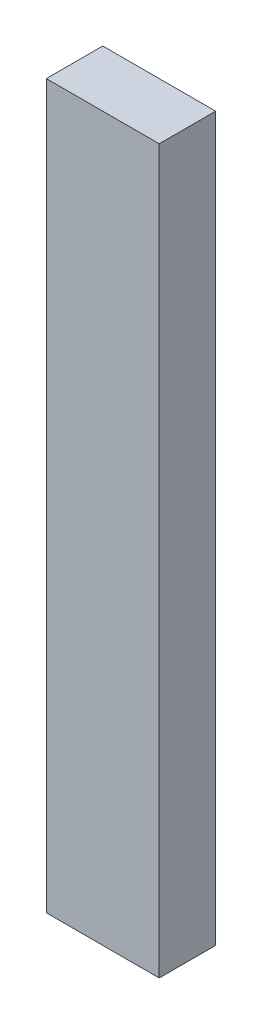
ISO-10303-21;
HEADER;
FILE_DESCRIPTION(('STEP AP214'),'2;1');
FILE_NAME('part.step','',(''),(''),'','','');
FILE_SCHEMA(('AUTOMOTIVE_DESIGN { 1 0 10303 214 1 1 1 1 }'));
ENDSEC;
DATA;
#1=APPLICATION_CONTEXT('core data for automotive mechanical design processes');
#2=APPLICATION_PROTOCOL_DEFINITION('international standard','automotive_design',2000,#1);
#3=PRODUCT_CONTEXT('',#1,'mechanical');
#4=PRODUCT('Part','Part','',(#3));
#5=PRODUCT_RELATED_PRODUCT_CATEGORY('part','',(#4));
#6=PRODUCT_DEFINITION_FORMATION('','',#4);
#7=PRODUCT_DEFINITION_CONTEXT('part definition',#1,'design');
#8=PRODUCT_DEFINITION('design','',#6,#7);
#9=PRODUCT_DEFINITION_SHAPE('','',#8);
#10=(LENGTH_UNIT() NAMED_UNIT(*) SI_UNIT(.MILLI.,.METRE.));
#11=(NAMED_UNIT(*) PLANE_ANGLE_UNIT() SI_UNIT($,.RADIAN.));
#12=(NAMED_UNIT(*) SI_UNIT($,.STERADIAN.) SOLID_ANGLE_UNIT());
#13=UNCERTAINTY_MEASURE_WITH_UNIT(LENGTH_MEASURE(1.E-05),#10,'distance_accuracy_value','');
#14=(GEOMETRIC_REPRESENTATION_CONTEXT(3) GLOBAL_UNCERTAINTY_ASSIGNED_CONTEXT((#13)) GLOBAL_UNIT_ASSIGNED_CONTEXT((#10,
#11,#12)) REPRESENTATION_CONTEXT('',''));
#15=CARTESIAN_POINT('',(0.,0.,0.));
#16=DIRECTION('',(0.,0.,1.));
#17=DIRECTION('',(1.,0.,0.));
#18=AXIS2_PLACEMENT_3D('',#15,#16,#17);
#19=CARTESIAN_POINT('',(0.25,3.2,-0.125));
#20=DIRECTION('',(-1.,0.,0.));
#21=DIRECTION('',(0.,0.,1.));
#22=AXIS2_PLACEMENT_3D('',#19,#20,#21);
#23=PLANE('',#22);
#24=DIRECTION('',(0.,0.,-1.));
#25=VECTOR('',#24,1.);
#26=CARTESIAN_POINT('',(0.25,0.,-0.125));
#27=LINE('',#26,#25);
#28=CARTESIAN_POINT('',(0.25,0.,0.125));
#29=VERTEX_POINT('',#28);
#30=CARTESIAN_POINT('',(0.25,0.,-0.125));
#31=VERTEX_POINT('',#30);
#32=EDGE_CURVE('E96',#29,#31,#27,.T.);
#33=ORIENTED_EDGE('',*,*,#32,.T.);
#34=DIRECTION('',(0.,-1.,0.));
#35=VECTOR('',#34,1.);
#36=CARTESIAN_POINT('',(0.25,3.2,-0.125));
#37=LINE('',#36,#35);
#38=CARTESIAN_POINT('',(0.25,3.2,-0.125));
#39=VERTEX_POINT('',#38);
#40=EDGE_CURVE('E11',#39,#31,#37,.T.);
#41=ORIENTED_EDGE('',*,*,#40,.F.);
#42=DIRECTION('',(0.,0.,-1.));
#43=VECTOR('',#42,1.);
#44=CARTESIAN_POINT('',(0.25,3.2,-0.125));
#45=LINE('',#44,#43);
#46=CARTESIAN_POINT('',(0.25,3.2,0.125));
#47=VERTEX_POINT('',#46);
#48=EDGE_CURVE('E84',#47,#39,#45,.T.);
#49=ORIENTED_EDGE('',*,*,#48,.F.);
#50=DIRECTION('',(0.,-1.,0.));
#51=VECTOR('',#50,1.);
#52=CARTESIAN_POINT('',(0.25,3.2,0.125));
#53=LINE('',#52,#51);
#54=EDGE_CURVE('E92',#47,#29,#53,.T.);
#55=ORIENTED_EDGE('',*,*,#54,.T.);
#56=EDGE_LOOP('',(#33,#41,#49,#55));
#57=FACE_BOUND('',#56,.T.);
#58=ADVANCED_FACE('F33',(#57),#23,.F.);
#59=CARTESIAN_POINT('',(-0.25,3.2,-0.125));
#60=DIRECTION('',(0.,0.,1.));
#61=DIRECTION('',(1.,0.,0.));
#62=AXIS2_PLACEMENT_3D('',#59,#60,#61);
#63=PLANE('',#62);
#64=DIRECTION('',(-1.,0.,0.));
#65=VECTOR('',#64,1.);
#66=CARTESIAN_POINT('',(-0.25,0.,-0.125));
#67=LINE('',#66,#65);
#68=CARTESIAN_POINT('',(-0.25,0.,-0.125));
#69=VERTEX_POINT('',#68);
#70=EDGE_CURVE('E88',#31,#69,#67,.T.);
#71=ORIENTED_EDGE('',*,*,#70,.T.);
#72=DIRECTION('',(0.,-1.,0.));
#73=VECTOR('',#72,1.);
#74=CARTESIAN_POINT('',(-0.25,3.2,-0.125));
#75=LINE('',#74,#73);
#76=CARTESIAN_POINT('',(-0.25,3.2,-0.125));
#77=VERTEX_POINT('',#76);
#78=EDGE_CURVE('E41',#77,#69,#75,.T.);
#79=ORIENTED_EDGE('',*,*,#78,.F.);
#80=DIRECTION('',(-1.,0.,0.));
#81=VECTOR('',#80,1.);
#82=CARTESIAN_POINT('',(-0.25,3.2,-0.125));
#83=LINE('',#82,#81);
#84=EDGE_CURVE('E79',#39,#77,#83,.T.);
#85=ORIENTED_EDGE('',*,*,#84,.F.);
#86=ORIENTED_EDGE('',*,*,#40,.T.);
#87=EDGE_LOOP('',(#71,#79,#85,#86));
#88=FACE_BOUND('',#87,.T.);
#89=ADVANCED_FACE('F87',(#88),#63,.F.);
#90=CARTESIAN_POINT('',(-0.25,3.2,-0.125));
#91=DIRECTION('',(1.,0.,0.));
#92=DIRECTION('',(0.,0.,-1.));
#93=AXIS2_PLACEMENT_3D('',#90,#91,#92);
#94=PLANE('',#93);
#95=DIRECTION('',(0.,0.,1.));
#96=VECTOR('',#95,1.);
#97=CARTESIAN_POINT('',(-0.25,0.,-0.125));
#98=LINE('',#97,#96);
#99=CARTESIAN_POINT('',(-0.25,0.,0.125));
#100=VERTEX_POINT('',#99);
#101=EDGE_CURVE('E66',#69,#100,#98,.T.);
#102=ORIENTED_EDGE('',*,*,#101,.T.);
#103=DIRECTION('',(0.,-1.,0.));
#104=VECTOR('',#103,1.);
#105=CARTESIAN_POINT('',(-0.25,3.2,0.125));
#106=LINE('',#105,#104);
#107=CARTESIAN_POINT('',(-0.25,3.2,0.125));
#108=VERTEX_POINT('',#107);
#109=EDGE_CURVE('E89',#108,#100,#106,.T.);
#110=ORIENTED_EDGE('',*,*,#109,.F.);
#111=DIRECTION('',(0.,0.,1.));
#112=VECTOR('',#111,1.);
#113=CARTESIAN_POINT('',(-0.25,3.2,-0.125));
#114=LINE('',#113,#112);
#115=EDGE_CURVE('E82',#77,#108,#114,.T.);
#116=ORIENTED_EDGE('',*,*,#115,.F.);
#117=ORIENTED_EDGE('',*,*,#78,.T.);
#118=EDGE_LOOP('',(#102,#110,#116,#117));
#119=FACE_BOUND('',#118,.T.);
#120=ADVANCED_FACE('F90',(#119),#94,.F.);
#121=CARTESIAN_POINT('',(-0.25,3.2,0.125));
#122=DIRECTION('',(0.,0.,-1.));
#123=DIRECTION('',(-1.,0.,0.));
#124=AXIS2_PLACEMENT_3D('',#121,#122,#123);
#125=PLANE('',#124);
#126=DIRECTION('',(1.,0.,0.));
#127=VECTOR('',#126,1.);
#128=CARTESIAN_POINT('',(-0.25,0.,0.125));
#129=LINE('',#128,#127);
#130=EDGE_CURVE('E72',#100,#29,#129,.T.);
#131=ORIENTED_EDGE('',*,*,#130,.T.);
#132=ORIENTED_EDGE('',*,*,#54,.F.);
#133=DIRECTION('',(1.,0.,0.));
#134=VECTOR('',#133,1.);
#135=CARTESIAN_POINT('',(-0.25,3.2,0.125));
#136=LINE('',#135,#134);
#137=EDGE_CURVE('E49',#108,#47,#136,.T.);
#138=ORIENTED_EDGE('',*,*,#137,.F.);
#139=ORIENTED_EDGE('',*,*,#109,.T.);
#140=EDGE_LOOP('',(#131,#132,#138,#139));
#141=FACE_BOUND('',#140,.T.);
#142=ADVANCED_FACE('F103',(#141),#125,.F.);
#143=CARTESIAN_POINT('',(0.,3.2,0.));
#144=DIRECTION('',(0.,1.,0.));
#145=DIRECTION('',(0.,0.,1.));
#146=AXIS2_PLACEMENT_3D('',#143,#144,#145);
#147=PLANE('',#146);
#148=ORIENTED_EDGE('',*,*,#48,.T.);
#149=ORIENTED_EDGE('',*,*,#84,.T.);
#150=ORIENTED_EDGE('',*,*,#115,.T.);
#151=ORIENTED_EDGE('',*,*,#137,.T.);
#152=EDGE_LOOP('',(#148,#149,#150,#151));
#153=FACE_BOUND('',#152,.T.);
#154=ADVANCED_FACE('F80',(#153),#147,.T.);
#155=CARTESIAN_POINT('',(0.,0.,0.));
#156=DIRECTION('',(0.,1.,0.));
#157=DIRECTION('',(0.,0.,1.));
#158=AXIS2_PLACEMENT_3D('',#155,#156,#157);
#159=PLANE('',#158);
#160=ORIENTED_EDGE('',*,*,#32,.F.);
#161=ORIENTED_EDGE('',*,*,#130,.F.);
#162=ORIENTED_EDGE('',*,*,#101,.F.);
#163=ORIENTED_EDGE('',*,*,#70,.F.);
#164=EDGE_LOOP('',(#160,#161,#162,#163));
#165=FACE_BOUND('',#164,.T.);
#166=ADVANCED_FACE('F106',(#165),#159,.F.);
#167=CLOSED_SHELL('',(#58,#89,#120,#142,#154,#166));
#168=MANIFOLD_SOLID_BREP('B2',#167);
#169=ADVANCED_BREP_SHAPE_REPRESENTATION('',(#18,#168),#14);
#170=SHAPE_DEFINITION_REPRESENTATION(#9,#169);
ENDSEC;
END-ISO-10303-21;
